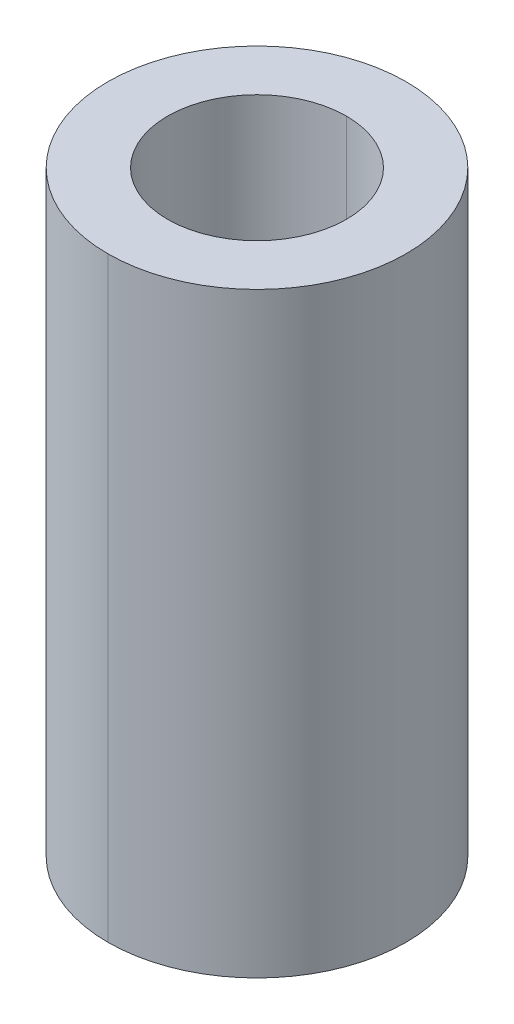
ISO-10303-21;
HEADER;
FILE_DESCRIPTION(('STEP AP214'),'2;1');
FILE_NAME('part.step','',(''),(''),'','','');
FILE_SCHEMA(('AUTOMOTIVE_DESIGN { 1 0 10303 214 1 1 1 1 }'));
ENDSEC;
DATA;
#1=APPLICATION_CONTEXT('core data for automotive mechanical design processes');
#2=APPLICATION_PROTOCOL_DEFINITION('international standard','automotive_design',2000,#1);
#3=PRODUCT_CONTEXT('',#1,'mechanical');
#4=PRODUCT('Part','Part','',(#3));
#5=PRODUCT_RELATED_PRODUCT_CATEGORY('part','',(#4));
#6=PRODUCT_DEFINITION_FORMATION('','',#4);
#7=PRODUCT_DEFINITION_CONTEXT('part definition',#1,'design');
#8=PRODUCT_DEFINITION('design','',#6,#7);
#9=PRODUCT_DEFINITION_SHAPE('','',#8);
#10=(LENGTH_UNIT() NAMED_UNIT(*) SI_UNIT(.MILLI.,.METRE.));
#11=(NAMED_UNIT(*) PLANE_ANGLE_UNIT() SI_UNIT($,.RADIAN.));
#12=(NAMED_UNIT(*) SI_UNIT($,.STERADIAN.) SOLID_ANGLE_UNIT());
#13=UNCERTAINTY_MEASURE_WITH_UNIT(LENGTH_MEASURE(1.E-05),#10,'distance_accuracy_value','');
#14=(GEOMETRIC_REPRESENTATION_CONTEXT(3) GLOBAL_UNCERTAINTY_ASSIGNED_CONTEXT((#13)) GLOBAL_UNIT_ASSIGNED_CONTEXT((#10,
#11,#12)) REPRESENTATION_CONTEXT('',''));
#15=CARTESIAN_POINT('',(0.,0.,0.));
#16=DIRECTION('',(0.,0.,1.));
#17=DIRECTION('',(1.,0.,0.));
#18=AXIS2_PLACEMENT_3D('',#15,#16,#17);
#19=CARTESIAN_POINT('',(0.,20.,0.));
#20=DIRECTION('',(0.,-1.,0.));
#21=DIRECTION('',(0.,0.,-1.));
#22=AXIS2_PLACEMENT_3D('',#19,#20,#21);
#23=CYLINDRICAL_SURFACE('',#22,3.);
#24=DIRECTION('',(0.,-1.,0.));
#25=VECTOR('',#24,1.);
#26=CARTESIAN_POINT('',(0.,20.,3.));
#27=LINE('',#26,#25);
#28=CARTESIAN_POINT('',(0.,20.,3.));
#29=VERTEX_POINT('',#28);
#30=CARTESIAN_POINT('',(0.,0.,3.));
#31=VERTEX_POINT('',#30);
#32=EDGE_CURVE('E86',#29,#31,#27,.T.);
#33=ORIENTED_EDGE('',*,*,#32,.F.);
#34=CARTESIAN_POINT('',(0.,20.,0.));
#35=DIRECTION('',(0.,1.,0.));
#36=DIRECTION('',(0.,0.,1.));
#37=AXIS2_PLACEMENT_3D('',#34,#35,#36);
#38=CIRCLE('',#37,3.);
#39=CARTESIAN_POINT('',(0.,20.,-3.));
#40=VERTEX_POINT('',#39);
#41=EDGE_CURVE('E77',#29,#40,#38,.T.);
#42=ORIENTED_EDGE('',*,*,#41,.T.);
#43=DIRECTION('',(0.,-1.,0.));
#44=VECTOR('',#43,1.);
#45=CARTESIAN_POINT('',(0.,20.,-3.));
#46=LINE('',#45,#44);
#47=CARTESIAN_POINT('',(0.,0.,-3.));
#48=VERTEX_POINT('',#47);
#49=EDGE_CURVE('E92',#40,#48,#46,.T.);
#50=ORIENTED_EDGE('',*,*,#49,.T.);
#51=CARTESIAN_POINT('',(0.,0.,0.));
#52=DIRECTION('',(0.,1.,0.));
#53=DIRECTION('',(0.,0.,1.));
#54=AXIS2_PLACEMENT_3D('',#51,#52,#53);
#55=CIRCLE('',#54,3.);
#56=EDGE_CURVE('E11',#31,#48,#55,.T.);
#57=ORIENTED_EDGE('',*,*,#56,.F.);
#58=EDGE_LOOP('',(#33,#42,#50,#57));
#59=FACE_BOUND('',#58,.T.);
#60=ADVANCED_FACE('F17',(#59),#23,.F.);
#61=CARTESIAN_POINT('',(0.,20.,0.));
#62=DIRECTION('',(0.,-1.,0.));
#63=DIRECTION('',(0.,0.,-1.));
#64=AXIS2_PLACEMENT_3D('',#61,#62,#63);
#65=CYLINDRICAL_SURFACE('',#64,5.);
#66=DIRECTION('',(0.,-1.,0.));
#67=VECTOR('',#66,1.);
#68=CARTESIAN_POINT('',(0.,20.,5.));
#69=LINE('',#68,#67);
#70=CARTESIAN_POINT('',(0.,20.,5.));
#71=VERTEX_POINT('',#70);
#72=CARTESIAN_POINT('',(0.,0.,5.));
#73=VERTEX_POINT('',#72);
#74=EDGE_CURVE('E105',#71,#73,#69,.T.);
#75=ORIENTED_EDGE('',*,*,#74,.F.);
#76=CARTESIAN_POINT('',(0.,20.,0.));
#77=DIRECTION('',(0.,1.,0.));
#78=DIRECTION('',(0.,0.,1.));
#79=AXIS2_PLACEMENT_3D('',#76,#77,#78);
#80=CIRCLE('',#79,5.);
#81=CARTESIAN_POINT('',(0.,20.,-5.));
#82=VERTEX_POINT('',#81);
#83=EDGE_CURVE('E21',#82,#71,#80,.T.);
#84=ORIENTED_EDGE('',*,*,#83,.F.);
#85=DIRECTION('',(0.,-1.,0.));
#86=VECTOR('',#85,1.);
#87=CARTESIAN_POINT('',(0.,20.,-5.));
#88=LINE('',#87,#86);
#89=CARTESIAN_POINT('',(0.,0.,-5.));
#90=VERTEX_POINT('',#89);
#91=EDGE_CURVE('E98',#82,#90,#88,.T.);
#92=ORIENTED_EDGE('',*,*,#91,.T.);
#93=CARTESIAN_POINT('',(0.,0.,0.));
#94=DIRECTION('',(0.,1.,0.));
#95=DIRECTION('',(0.,0.,1.));
#96=AXIS2_PLACEMENT_3D('',#93,#94,#95);
#97=CIRCLE('',#96,5.);
#98=EDGE_CURVE('E28',#90,#73,#97,.T.);
#99=ORIENTED_EDGE('',*,*,#98,.T.);
#100=EDGE_LOOP('',(#75,#84,#92,#99));
#101=FACE_BOUND('',#100,.T.);
#102=ADVANCED_FACE('F121',(#101),#65,.T.);
#103=CARTESIAN_POINT('',(0.,0.,0.));
#104=DIRECTION('',(0.,1.,0.));
#105=DIRECTION('',(1.,0.,0.));
#106=AXIS2_PLACEMENT_3D('',#103,#104,#105);
#107=PLANE('',#106);
#108=CARTESIAN_POINT('',(0.,0.,0.));
#109=DIRECTION('',(0.,1.,0.));
#110=DIRECTION('',(0.,0.,1.));
#111=AXIS2_PLACEMENT_3D('',#108,#109,#110);
#112=CIRCLE('',#111,3.);
#113=EDGE_CURVE('E90',#48,#31,#112,.T.);
#114=ORIENTED_EDGE('',*,*,#113,.T.);
#115=ORIENTED_EDGE('',*,*,#56,.T.);
#116=EDGE_LOOP('',(#114,#115));
#117=FACE_BOUND('',#116,.T.);
#118=ORIENTED_EDGE('',*,*,#98,.F.);
#119=CARTESIAN_POINT('',(0.,0.,0.));
#120=DIRECTION('',(0.,1.,0.));
#121=DIRECTION('',(0.,0.,1.));
#122=AXIS2_PLACEMENT_3D('',#119,#120,#121);
#123=CIRCLE('',#122,5.);
#124=EDGE_CURVE('E101',#73,#90,#123,.T.);
#125=ORIENTED_EDGE('',*,*,#124,.F.);
#126=EDGE_LOOP('',(#118,#125));
#127=FACE_BOUND('',#126,.T.);
#128=ADVANCED_FACE('F124',(#117,#127),#107,.F.);
#129=CARTESIAN_POINT('',(0.,20.,0.));
#130=DIRECTION('',(0.,1.,0.));
#131=DIRECTION('',(1.,0.,0.));
#132=AXIS2_PLACEMENT_3D('',#129,#130,#131);
#133=PLANE('',#132);
#134=CARTESIAN_POINT('',(0.,20.,0.));
#135=DIRECTION('',(0.,1.,0.));
#136=DIRECTION('',(0.,0.,1.));
#137=AXIS2_PLACEMENT_3D('',#134,#135,#136);
#138=CIRCLE('',#137,3.);
#139=EDGE_CURVE('E81',#40,#29,#138,.T.);
#140=ORIENTED_EDGE('',*,*,#139,.F.);
#141=ORIENTED_EDGE('',*,*,#41,.F.);
#142=EDGE_LOOP('',(#140,#141));
#143=FACE_BOUND('',#142,.T.);
#144=ORIENTED_EDGE('',*,*,#83,.T.);
#145=CARTESIAN_POINT('',(0.,20.,0.));
#146=DIRECTION('',(0.,1.,0.));
#147=DIRECTION('',(0.,0.,1.));
#148=AXIS2_PLACEMENT_3D('',#145,#146,#147);
#149=CIRCLE('',#148,5.);
#150=EDGE_CURVE('E106',#71,#82,#149,.T.);
#151=ORIENTED_EDGE('',*,*,#150,.T.);
#152=EDGE_LOOP('',(#144,#151));
#153=FACE_BOUND('',#152,.T.);
#154=ADVANCED_FACE('F78',(#143,#153),#133,.T.);
#155=CARTESIAN_POINT('',(0.,20.,0.));
#156=DIRECTION('',(0.,-1.,0.));
#157=DIRECTION('',(0.,0.,-1.));
#158=AXIS2_PLACEMENT_3D('',#155,#156,#157);
#159=CYLINDRICAL_SURFACE('',#158,5.);
#160=ORIENTED_EDGE('',*,*,#150,.F.);
#161=ORIENTED_EDGE('',*,*,#74,.T.);
#162=ORIENTED_EDGE('',*,*,#124,.T.);
#163=ORIENTED_EDGE('',*,*,#91,.F.);
#164=EDGE_LOOP('',(#160,#161,#162,#163));
#165=FACE_BOUND('',#164,.T.);
#166=ADVANCED_FACE('F126',(#165),#159,.T.);
#167=CARTESIAN_POINT('',(0.,20.,0.));
#168=DIRECTION('',(0.,-1.,0.));
#169=DIRECTION('',(0.,0.,-1.));
#170=AXIS2_PLACEMENT_3D('',#167,#168,#169);
#171=CYLINDRICAL_SURFACE('',#170,3.);
#172=ORIENTED_EDGE('',*,*,#139,.T.);
#173=ORIENTED_EDGE('',*,*,#32,.T.);
#174=ORIENTED_EDGE('',*,*,#113,.F.);
#175=ORIENTED_EDGE('',*,*,#49,.F.);
#176=EDGE_LOOP('',(#172,#173,#174,#175));
#177=FACE_BOUND('',#176,.T.);
#178=ADVANCED_FACE('F19',(#177),#171,.F.);
#179=CLOSED_SHELL('',(#60,#102,#128,#154,#166,#178));
#180=MANIFOLD_SOLID_BREP('B1',#179);
#181=ADVANCED_BREP_SHAPE_REPRESENTATION('',(#18,#180),#14);
#182=SHAPE_DEFINITION_REPRESENTATION(#9,#181);
ENDSEC;
END-ISO-10303-21;
